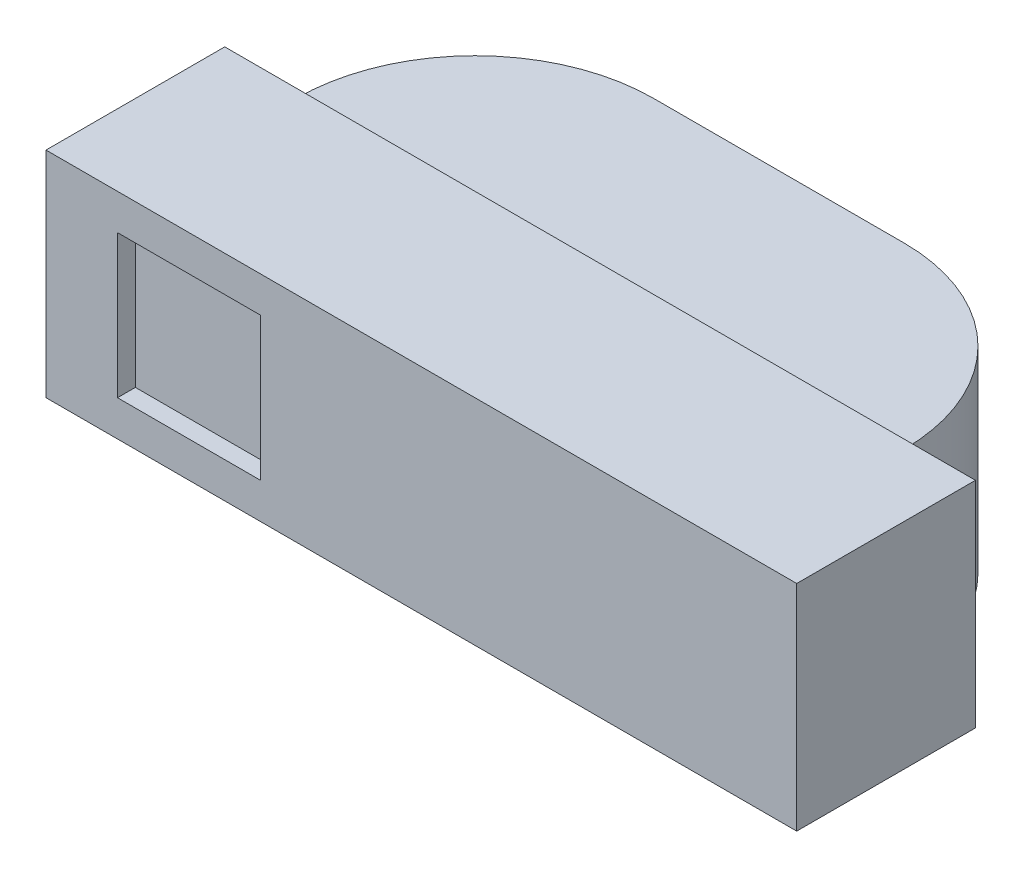
ISO-10303-21;
HEADER;
FILE_DESCRIPTION(('STEP AP214'),'2;1');
FILE_NAME('part.step','',(''),(''),'','','');
FILE_SCHEMA(('AUTOMOTIVE_DESIGN { 1 0 10303 214 1 1 1 1 }'));
ENDSEC;
DATA;
#1=APPLICATION_CONTEXT('core data for automotive mechanical design processes');
#2=APPLICATION_PROTOCOL_DEFINITION('international standard','automotive_design',2000,#1);
#3=PRODUCT_CONTEXT('',#1,'mechanical');
#4=PRODUCT('Part','Part','',(#3));
#5=PRODUCT_RELATED_PRODUCT_CATEGORY('part','',(#4));
#6=PRODUCT_DEFINITION_FORMATION('','',#4);
#7=PRODUCT_DEFINITION_CONTEXT('part definition',#1,'design');
#8=PRODUCT_DEFINITION('design','',#6,#7);
#9=PRODUCT_DEFINITION_SHAPE('','',#8);
#10=(LENGTH_UNIT() NAMED_UNIT(*) SI_UNIT(.MILLI.,.METRE.));
#11=(NAMED_UNIT(*) PLANE_ANGLE_UNIT() SI_UNIT($,.RADIAN.));
#12=(NAMED_UNIT(*) SI_UNIT($,.STERADIAN.) SOLID_ANGLE_UNIT());
#13=UNCERTAINTY_MEASURE_WITH_UNIT(LENGTH_MEASURE(1.E-05),#10,'distance_accuracy_value','');
#14=(GEOMETRIC_REPRESENTATION_CONTEXT(3) GLOBAL_UNCERTAINTY_ASSIGNED_CONTEXT((#13)) GLOBAL_UNIT_ASSIGNED_CONTEXT((#10,
#11,#12)) REPRESENTATION_CONTEXT('',''));
#15=CARTESIAN_POINT('',(0.,0.,0.));
#16=DIRECTION('',(0.,0.,1.));
#17=DIRECTION('',(1.,0.,0.));
#18=AXIS2_PLACEMENT_3D('',#15,#16,#17);
#19=CARTESIAN_POINT('',(-0.35,0.6,0.));
#20=DIRECTION('',(0.,1.,0.));
#21=DIRECTION('',(0.,0.,1.));
#22=AXIS2_PLACEMENT_3D('',#19,#20,#21);
#23=PLANE('',#22);
#24=DIRECTION('',(-1.,0.,0.));
#25=VECTOR('',#24,1.);
#26=CARTESIAN_POINT('',(0.85,0.6,0.));
#27=LINE('',#26,#25);
#28=CARTESIAN_POINT('',(1.05,0.6,0.));
#29=VERTEX_POINT('',#28);
#30=CARTESIAN_POINT('',(-1.05,0.6,0.));
#31=VERTEX_POINT('',#30);
#32=EDGE_CURVE('E59',#29,#31,#27,.T.);
#33=ORIENTED_EDGE('',*,*,#32,.T.);
#34=DIRECTION('',(0.,0.,1.));
#35=VECTOR('',#34,1.);
#36=CARTESIAN_POINT('',(-1.05,0.6,0.5));
#37=LINE('',#36,#35);
#38=CARTESIAN_POINT('',(-1.05,0.6,0.5));
#39=VERTEX_POINT('',#38);
#40=EDGE_CURVE('E194',#31,#39,#37,.T.);
#41=ORIENTED_EDGE('',*,*,#40,.T.);
#42=DIRECTION('',(1.,0.,0.));
#43=VECTOR('',#42,1.);
#44=CARTESIAN_POINT('',(-1.05,0.6,0.5));
#45=LINE('',#44,#43);
#46=CARTESIAN_POINT('',(1.05,0.6,0.5));
#47=VERTEX_POINT('',#46);
#48=EDGE_CURVE('E87',#39,#47,#45,.T.);
#49=ORIENTED_EDGE('',*,*,#48,.T.);
#50=DIRECTION('',(0.,0.,-1.));
#51=VECTOR('',#50,1.);
#52=CARTESIAN_POINT('',(1.05,0.6,0.5));
#53=LINE('',#52,#51);
#54=EDGE_CURVE('E198',#47,#29,#53,.T.);
#55=ORIENTED_EDGE('',*,*,#54,.T.);
#56=EDGE_LOOP('',(#33,#41,#49,#55));
#57=FACE_BOUND('',#56,.T.);
#58=ADVANCED_FACE('F35',(#57),#23,.T.);
#59=CARTESIAN_POINT('',(-1.05,0.6,0.5));
#60=DIRECTION('',(1.,0.,0.));
#61=DIRECTION('',(0.,0.,-1.));
#62=AXIS2_PLACEMENT_3D('',#59,#60,#61);
#63=PLANE('',#62);
#64=DIRECTION('',(0.,0.,1.));
#65=VECTOR('',#64,1.);
#66=CARTESIAN_POINT('',(-1.05,0.,0.5));
#67=LINE('',#66,#65);
#68=CARTESIAN_POINT('',(-1.05,0.,0.));
#69=VERTEX_POINT('',#68);
#70=CARTESIAN_POINT('',(-1.05,0.,0.5));
#71=VERTEX_POINT('',#70);
#72=EDGE_CURVE('E193',#69,#71,#67,.T.);
#73=ORIENTED_EDGE('',*,*,#72,.T.);
#74=DIRECTION('',(0.,-1.,0.));
#75=VECTOR('',#74,1.);
#76=CARTESIAN_POINT('',(-1.05,0.6,0.5));
#77=LINE('',#76,#75);
#78=EDGE_CURVE('E11',#39,#71,#77,.T.);
#79=ORIENTED_EDGE('',*,*,#78,.F.);
#80=ORIENTED_EDGE('',*,*,#40,.F.);
#81=DIRECTION('',(0.,-1.,0.));
#82=VECTOR('',#81,1.);
#83=CARTESIAN_POINT('',(-1.05,0.6,0.));
#84=LINE('',#83,#82);
#85=EDGE_CURVE('E80',#31,#69,#84,.T.);
#86=ORIENTED_EDGE('',*,*,#85,.T.);
#87=EDGE_LOOP('',(#73,#79,#80,#86));
#88=FACE_BOUND('',#87,.T.);
#89=ADVANCED_FACE('F37',(#88),#63,.F.);
#90=CARTESIAN_POINT('',(-1.05,0.6,0.5));
#91=DIRECTION('',(0.,0.,-1.));
#92=DIRECTION('',(-1.,0.,0.));
#93=AXIS2_PLACEMENT_3D('',#90,#91,#92);
#94=PLANE('',#93);
#95=DIRECTION('',(1.,0.,0.));
#96=VECTOR('',#95,1.);
#97=CARTESIAN_POINT('',(-0.85,0.1,0.5));
#98=LINE('',#97,#96);
#99=CARTESIAN_POINT('',(-0.85,0.1,0.5));
#100=VERTEX_POINT('',#99);
#101=CARTESIAN_POINT('',(-0.45,0.1,0.5));
#102=VERTEX_POINT('',#101);
#103=EDGE_CURVE('E162',#100,#102,#98,.T.);
#104=ORIENTED_EDGE('',*,*,#103,.F.);
#105=DIRECTION('',(0.,-1.,0.));
#106=VECTOR('',#105,1.);
#107=CARTESIAN_POINT('',(-0.85,0.5,0.5));
#108=LINE('',#107,#106);
#109=CARTESIAN_POINT('',(-0.85,0.5,0.5));
#110=VERTEX_POINT('',#109);
#111=EDGE_CURVE('E50',#110,#100,#108,.T.);
#112=ORIENTED_EDGE('',*,*,#111,.F.);
#113=DIRECTION('',(-1.,0.,0.));
#114=VECTOR('',#113,1.);
#115=CARTESIAN_POINT('',(-0.85,0.5,0.5));
#116=LINE('',#115,#114);
#117=CARTESIAN_POINT('',(-0.45,0.5,0.5));
#118=VERTEX_POINT('',#117);
#119=EDGE_CURVE('E153',#118,#110,#116,.T.);
#120=ORIENTED_EDGE('',*,*,#119,.F.);
#121=DIRECTION('',(0.,1.,0.));
#122=VECTOR('',#121,1.);
#123=CARTESIAN_POINT('',(-0.45,0.5,0.5));
#124=LINE('',#123,#122);
#125=EDGE_CURVE('E156',#102,#118,#124,.T.);
#126=ORIENTED_EDGE('',*,*,#125,.F.);
#127=EDGE_LOOP('',(#104,#112,#120,#126));
#128=FACE_BOUND('',#127,.T.);
#129=DIRECTION('',(1.,0.,0.));
#130=VECTOR('',#129,1.);
#131=CARTESIAN_POINT('',(-1.05,0.,0.5));
#132=LINE('',#131,#130);
#133=CARTESIAN_POINT('',(1.05,0.,0.5));
#134=VERTEX_POINT('',#133);
#135=EDGE_CURVE('E202',#71,#134,#132,.T.);
#136=ORIENTED_EDGE('',*,*,#135,.T.);
#137=DIRECTION('',(0.,-1.,0.));
#138=VECTOR('',#137,1.);
#139=CARTESIAN_POINT('',(1.05,0.6,0.5));
#140=LINE('',#139,#138);
#141=EDGE_CURVE('E43',#47,#134,#140,.T.);
#142=ORIENTED_EDGE('',*,*,#141,.F.);
#143=ORIENTED_EDGE('',*,*,#48,.F.);
#144=ORIENTED_EDGE('',*,*,#78,.T.);
#145=EDGE_LOOP('',(#136,#142,#143,#144));
#146=FACE_BOUND('',#145,.T.);
#147=ADVANCED_FACE('F240',(#128,#146),#94,.F.);
#148=CARTESIAN_POINT('',(1.05,0.6,0.5));
#149=DIRECTION('',(-1.,0.,0.));
#150=DIRECTION('',(0.,0.,1.));
#151=AXIS2_PLACEMENT_3D('',#148,#149,#150);
#152=PLANE('',#151);
#153=DIRECTION('',(0.,0.,-1.));
#154=VECTOR('',#153,1.);
#155=CARTESIAN_POINT('',(1.05,0.,0.5));
#156=LINE('',#155,#154);
#157=CARTESIAN_POINT('',(1.05,0.,0.));
#158=VERTEX_POINT('',#157);
#159=EDGE_CURVE('E204',#134,#158,#156,.T.);
#160=ORIENTED_EDGE('',*,*,#159,.T.);
#161=DIRECTION('',(0.,-1.,0.));
#162=VECTOR('',#161,1.);
#163=CARTESIAN_POINT('',(1.05,0.6,0.));
#164=LINE('',#163,#162);
#165=EDGE_CURVE('E221',#29,#158,#164,.T.);
#166=ORIENTED_EDGE('',*,*,#165,.F.);
#167=ORIENTED_EDGE('',*,*,#54,.F.);
#168=ORIENTED_EDGE('',*,*,#141,.T.);
#169=EDGE_LOOP('',(#160,#166,#167,#168));
#170=FACE_BOUND('',#169,.T.);
#171=ADVANCED_FACE('F226',(#170),#152,.F.);
#172=CARTESIAN_POINT('',(0.35,0.6,0.));
#173=DIRECTION('',(0.,-1.,0.));
#174=DIRECTION('',(0.,0.,-1.));
#175=AXIS2_PLACEMENT_3D('',#172,#173,#174);
#176=CYLINDRICAL_SURFACE('',#175,0.5);
#177=DIRECTION('',(0.,-1.,0.));
#178=VECTOR('',#177,1.);
#179=CARTESIAN_POINT('',(0.85,0.6,0.));
#180=LINE('',#179,#178);
#181=CARTESIAN_POINT('',(0.85,0.575,0.));
#182=VERTEX_POINT('',#181);
#183=CARTESIAN_POINT('',(0.85,0.025,0.));
#184=VERTEX_POINT('',#183);
#185=EDGE_CURVE('E218',#182,#184,#180,.T.);
#186=ORIENTED_EDGE('',*,*,#185,.T.);
#187=CARTESIAN_POINT('',(0.35,0.025,0.));
#188=DIRECTION('',(0.,1.,0.));
#189=DIRECTION('',(-1.,0.,0.));
#190=AXIS2_PLACEMENT_3D('',#187,#188,#189);
#191=CIRCLE('',#190,0.5);
#192=CARTESIAN_POINT('',(0.35,0.025,-0.5));
#193=VERTEX_POINT('',#192);
#194=EDGE_CURVE('E179',#184,#193,#191,.T.);
#195=ORIENTED_EDGE('',*,*,#194,.T.);
#196=DIRECTION('',(0.,-1.,0.));
#197=VECTOR('',#196,1.);
#198=CARTESIAN_POINT('',(0.35,0.6,-0.5));
#199=LINE('',#198,#197);
#200=CARTESIAN_POINT('',(0.35,0.575,-0.5));
#201=VERTEX_POINT('',#200);
#202=EDGE_CURVE('E215',#201,#193,#199,.T.);
#203=ORIENTED_EDGE('',*,*,#202,.F.);
#204=CARTESIAN_POINT('',(0.35,0.575,0.));
#205=DIRECTION('',(0.,-1.,0.));
#206=DIRECTION('',(0.,0.,-1.));
#207=AXIS2_PLACEMENT_3D('',#204,#205,#206);
#208=CIRCLE('',#207,0.5);
#209=EDGE_CURVE('E190',#201,#182,#208,.T.);
#210=ORIENTED_EDGE('',*,*,#209,.T.);
#211=EDGE_LOOP('',(#186,#195,#203,#210));
#212=FACE_BOUND('',#211,.T.);
#213=ADVANCED_FACE('F257',(#212),#176,.T.);
#214=CARTESIAN_POINT('',(-0.35,0.6,-0.5));
#215=DIRECTION('',(0.,0.,1.));
#216=DIRECTION('',(1.,0.,0.));
#217=AXIS2_PLACEMENT_3D('',#214,#215,#216);
#218=PLANE('',#217);
#219=ORIENTED_EDGE('',*,*,#202,.T.);
#220=DIRECTION('',(1.,0.,0.));
#221=VECTOR('',#220,1.);
#222=CARTESIAN_POINT('',(1.05,0.025,-0.5));
#223=LINE('',#222,#221);
#224=CARTESIAN_POINT('',(-0.35,0.025,-0.5));
#225=VERTEX_POINT('',#224);
#226=EDGE_CURVE('E168',#225,#193,#223,.T.);
#227=ORIENTED_EDGE('',*,*,#226,.F.);
#228=DIRECTION('',(0.,-1.,0.));
#229=VECTOR('',#228,1.);
#230=CARTESIAN_POINT('',(-0.35,0.6,-0.5));
#231=LINE('',#230,#229);
#232=CARTESIAN_POINT('',(-0.35,0.575,-0.5));
#233=VERTEX_POINT('',#232);
#234=EDGE_CURVE('E212',#233,#225,#231,.T.);
#235=ORIENTED_EDGE('',*,*,#234,.F.);
#236=DIRECTION('',(-1.,0.,0.));
#237=VECTOR('',#236,1.);
#238=CARTESIAN_POINT('',(1.05,0.575,-0.5));
#239=LINE('',#238,#237);
#240=EDGE_CURVE('E182',#201,#233,#239,.T.);
#241=ORIENTED_EDGE('',*,*,#240,.F.);
#242=EDGE_LOOP('',(#219,#227,#235,#241));
#243=FACE_BOUND('',#242,.T.);
#244=ADVANCED_FACE('F253',(#243),#218,.F.);
#245=CARTESIAN_POINT('',(-0.35,0.6,0.));
#246=DIRECTION('',(0.,-1.,0.));
#247=DIRECTION('',(0.,0.,-1.));
#248=AXIS2_PLACEMENT_3D('',#245,#246,#247);
#249=CYLINDRICAL_SURFACE('',#248,0.5);
#250=ORIENTED_EDGE('',*,*,#234,.T.);
#251=CARTESIAN_POINT('',(-0.35,0.025,0.));
#252=DIRECTION('',(0.,1.,0.));
#253=DIRECTION('',(-1.,0.,0.));
#254=AXIS2_PLACEMENT_3D('',#251,#252,#253);
#255=CIRCLE('',#254,0.5);
#256=CARTESIAN_POINT('',(-0.85,0.025,0.));
#257=VERTEX_POINT('',#256);
#258=EDGE_CURVE('E175',#225,#257,#255,.T.);
#259=ORIENTED_EDGE('',*,*,#258,.T.);
#260=DIRECTION('',(0.,-1.,0.));
#261=VECTOR('',#260,1.);
#262=CARTESIAN_POINT('',(-0.85,0.6,0.));
#263=LINE('',#262,#261);
#264=CARTESIAN_POINT('',(-0.85,0.575,0.));
#265=VERTEX_POINT('',#264);
#266=EDGE_CURVE('E209',#265,#257,#263,.T.);
#267=ORIENTED_EDGE('',*,*,#266,.F.);
#268=CARTESIAN_POINT('',(-0.35,0.575,0.));
#269=DIRECTION('',(0.,-1.,0.));
#270=DIRECTION('',(0.,0.,-1.));
#271=AXIS2_PLACEMENT_3D('',#268,#269,#270);
#272=CIRCLE('',#271,0.5);
#273=EDGE_CURVE('E186',#265,#233,#272,.T.);
#274=ORIENTED_EDGE('',*,*,#273,.T.);
#275=EDGE_LOOP('',(#250,#259,#267,#274));
#276=FACE_BOUND('',#275,.T.);
#277=ADVANCED_FACE('F249',(#276),#249,.T.);
#278=CARTESIAN_POINT('',(-1.05,0.6,0.));
#279=DIRECTION('',(0.,0.,1.));
#280=DIRECTION('',(1.,0.,0.));
#281=AXIS2_PLACEMENT_3D('',#278,#279,#280);
#282=PLANE('',#281);
#283=DIRECTION('',(1.,0.,0.));
#284=VECTOR('',#283,1.);
#285=CARTESIAN_POINT('',(1.05,0.025,0.));
#286=LINE('',#285,#284);
#287=EDGE_CURVE('E172',#257,#184,#286,.T.);
#288=ORIENTED_EDGE('',*,*,#287,.T.);
#289=ORIENTED_EDGE('',*,*,#185,.F.);
#290=DIRECTION('',(-1.,0.,0.));
#291=VECTOR('',#290,1.);
#292=CARTESIAN_POINT('',(1.05,0.575,0.));
#293=LINE('',#292,#291);
#294=EDGE_CURVE('E183',#182,#265,#293,.T.);
#295=ORIENTED_EDGE('',*,*,#294,.T.);
#296=ORIENTED_EDGE('',*,*,#266,.T.);
#297=EDGE_LOOP('',(#288,#289,#295,#296));
#298=FACE_BOUND('',#297,.T.);
#299=ORIENTED_EDGE('',*,*,#165,.T.);
#300=DIRECTION('',(-1.,0.,0.));
#301=VECTOR('',#300,1.);
#302=CARTESIAN_POINT('',(-1.05,0.,0.));
#303=LINE('',#302,#301);
#304=EDGE_CURVE('E196',#158,#69,#303,.T.);
#305=ORIENTED_EDGE('',*,*,#304,.T.);
#306=ORIENTED_EDGE('',*,*,#85,.F.);
#307=ORIENTED_EDGE('',*,*,#32,.F.);
#308=EDGE_LOOP('',(#299,#305,#306,#307));
#309=FACE_BOUND('',#308,.T.);
#310=ADVANCED_FACE('F233',(#298,#309),#282,.F.);
#311=CARTESIAN_POINT('',(-0.35,0.,0.));
#312=DIRECTION('',(0.,1.,0.));
#313=DIRECTION('',(0.,0.,1.));
#314=AXIS2_PLACEMENT_3D('',#311,#312,#313);
#315=PLANE('',#314);
#316=ORIENTED_EDGE('',*,*,#304,.F.);
#317=ORIENTED_EDGE('',*,*,#159,.F.);
#318=ORIENTED_EDGE('',*,*,#135,.F.);
#319=ORIENTED_EDGE('',*,*,#72,.F.);
#320=EDGE_LOOP('',(#316,#317,#318,#319));
#321=FACE_BOUND('',#320,.T.);
#322=ADVANCED_FACE('F230',(#321),#315,.F.);
#323=CARTESIAN_POINT('',(1.05,0.575,0.));
#324=DIRECTION('',(0.,-1.,0.));
#325=DIRECTION('',(0.,0.,-1.));
#326=AXIS2_PLACEMENT_3D('',#323,#324,#325);
#327=PLANE('',#326);
#328=ORIENTED_EDGE('',*,*,#240,.T.);
#329=ORIENTED_EDGE('',*,*,#273,.F.);
#330=ORIENTED_EDGE('',*,*,#294,.F.);
#331=ORIENTED_EDGE('',*,*,#209,.F.);
#332=EDGE_LOOP('',(#328,#329,#330,#331));
#333=FACE_BOUND('',#332,.T.);
#334=ADVANCED_FACE('F243',(#333),#327,.F.);
#335=CARTESIAN_POINT('',(1.05,0.025,0.));
#336=DIRECTION('',(0.,1.,0.));
#337=DIRECTION('',(-1.,0.,0.));
#338=AXIS2_PLACEMENT_3D('',#335,#336,#337);
#339=PLANE('',#338);
#340=ORIENTED_EDGE('',*,*,#287,.F.);
#341=ORIENTED_EDGE('',*,*,#258,.F.);
#342=ORIENTED_EDGE('',*,*,#226,.T.);
#343=ORIENTED_EDGE('',*,*,#194,.F.);
#344=EDGE_LOOP('',(#340,#341,#342,#343));
#345=FACE_BOUND('',#344,.T.);
#346=ADVANCED_FACE('F280',(#345),#339,.F.);
#347=CARTESIAN_POINT('',(-0.85,0.5,0.45));
#348=DIRECTION('',(-1.,0.,0.));
#349=DIRECTION('',(0.,0.,1.));
#350=AXIS2_PLACEMENT_3D('',#347,#348,#349);
#351=PLANE('',#350);
#352=ORIENTED_EDGE('',*,*,#111,.T.);
#353=DIRECTION('',(0.,0.,1.));
#354=VECTOR('',#353,1.);
#355=CARTESIAN_POINT('',(-0.85,0.1,0.45));
#356=LINE('',#355,#354);
#357=CARTESIAN_POINT('',(-0.85,0.1,0.45));
#358=VERTEX_POINT('',#357);
#359=EDGE_CURVE('E131',#358,#100,#356,.T.);
#360=ORIENTED_EDGE('',*,*,#359,.F.);
#361=DIRECTION('',(0.,-1.,0.));
#362=VECTOR('',#361,1.);
#363=CARTESIAN_POINT('',(-0.85,0.5,0.45));
#364=LINE('',#363,#362);
#365=CARTESIAN_POINT('',(-0.85,0.5,0.45));
#366=VERTEX_POINT('',#365);
#367=EDGE_CURVE('E135',#366,#358,#364,.T.);
#368=ORIENTED_EDGE('',*,*,#367,.F.);
#369=DIRECTION('',(0.,0.,1.));
#370=VECTOR('',#369,1.);
#371=CARTESIAN_POINT('',(-0.85,0.5,0.45));
#372=LINE('',#371,#370);
#373=EDGE_CURVE('E166',#366,#110,#372,.T.);
#374=ORIENTED_EDGE('',*,*,#373,.T.);
#375=EDGE_LOOP('',(#352,#360,#368,#374));
#376=FACE_BOUND('',#375,.T.);
#377=ADVANCED_FACE('F133',(#376),#351,.F.);
#378=CARTESIAN_POINT('',(-0.85,0.5,0.45));
#379=DIRECTION('',(0.,1.,0.));
#380=DIRECTION('',(0.,0.,1.));
#381=AXIS2_PLACEMENT_3D('',#378,#379,#380);
#382=PLANE('',#381);
#383=ORIENTED_EDGE('',*,*,#119,.T.);
#384=ORIENTED_EDGE('',*,*,#373,.F.);
#385=DIRECTION('',(-1.,0.,0.));
#386=VECTOR('',#385,1.);
#387=CARTESIAN_POINT('',(-0.85,0.5,0.45));
#388=LINE('',#387,#386);
#389=CARTESIAN_POINT('',(-0.45,0.5,0.45));
#390=VERTEX_POINT('',#389);
#391=EDGE_CURVE('E141',#390,#366,#388,.T.);
#392=ORIENTED_EDGE('',*,*,#391,.F.);
#393=DIRECTION('',(0.,0.,1.));
#394=VECTOR('',#393,1.);
#395=CARTESIAN_POINT('',(-0.45,0.5,0.45));
#396=LINE('',#395,#394);
#397=EDGE_CURVE('E169',#390,#118,#396,.T.);
#398=ORIENTED_EDGE('',*,*,#397,.T.);
#399=EDGE_LOOP('',(#383,#384,#392,#398));
#400=FACE_BOUND('',#399,.T.);
#401=ADVANCED_FACE('F272',(#400),#382,.F.);
#402=CARTESIAN_POINT('',(-0.45,0.5,0.45));
#403=DIRECTION('',(1.,0.,0.));
#404=DIRECTION('',(0.,1.,0.));
#405=AXIS2_PLACEMENT_3D('',#402,#403,#404);
#406=PLANE('',#405);
#407=ORIENTED_EDGE('',*,*,#125,.T.);
#408=ORIENTED_EDGE('',*,*,#397,.F.);
#409=DIRECTION('',(0.,1.,0.));
#410=VECTOR('',#409,1.);
#411=CARTESIAN_POINT('',(-0.45,0.5,0.45));
#412=LINE('',#411,#410);
#413=CARTESIAN_POINT('',(-0.45,0.1,0.45));
#414=VERTEX_POINT('',#413);
#415=EDGE_CURVE('E149',#414,#390,#412,.T.);
#416=ORIENTED_EDGE('',*,*,#415,.F.);
#417=DIRECTION('',(0.,0.,1.));
#418=VECTOR('',#417,1.);
#419=CARTESIAN_POINT('',(-0.45,0.1,0.45));
#420=LINE('',#419,#418);
#421=EDGE_CURVE('E140',#414,#102,#420,.T.);
#422=ORIENTED_EDGE('',*,*,#421,.T.);
#423=EDGE_LOOP('',(#407,#408,#416,#422));
#424=FACE_BOUND('',#423,.T.);
#425=ADVANCED_FACE('F270',(#424),#406,.F.);
#426=CARTESIAN_POINT('',(-0.85,0.1,0.45));
#427=DIRECTION('',(0.,-1.,0.));
#428=DIRECTION('',(0.,0.,-1.));
#429=AXIS2_PLACEMENT_3D('',#426,#427,#428);
#430=PLANE('',#429);
#431=ORIENTED_EDGE('',*,*,#103,.T.);
#432=ORIENTED_EDGE('',*,*,#421,.F.);
#433=DIRECTION('',(1.,0.,0.));
#434=VECTOR('',#433,1.);
#435=CARTESIAN_POINT('',(-0.85,0.1,0.45));
#436=LINE('',#435,#434);
#437=EDGE_CURVE('E144',#358,#414,#436,.T.);
#438=ORIENTED_EDGE('',*,*,#437,.F.);
#439=ORIENTED_EDGE('',*,*,#359,.T.);
#440=EDGE_LOOP('',(#431,#432,#438,#439));
#441=FACE_BOUND('',#440,.T.);
#442=ADVANCED_FACE('F145',(#441),#430,.F.);
#443=CARTESIAN_POINT('',(-0.85,0.1,0.45));
#444=DIRECTION('',(0.,0.,1.));
#445=DIRECTION('',(1.,0.,0.));
#446=AXIS2_PLACEMENT_3D('',#443,#444,#445);
#447=PLANE('',#446);
#448=ORIENTED_EDGE('',*,*,#367,.T.);
#449=ORIENTED_EDGE('',*,*,#437,.T.);
#450=ORIENTED_EDGE('',*,*,#415,.T.);
#451=ORIENTED_EDGE('',*,*,#391,.T.);
#452=EDGE_LOOP('',(#448,#449,#450,#451));
#453=FACE_BOUND('',#452,.T.);
#454=ADVANCED_FACE('F151',(#453),#447,.T.);
#455=CLOSED_SHELL('',(#58,#89,#147,#171,#213,#244,#277,#310,#322,#334,#346,#377,#401,#425,#442,#454));
#456=MANIFOLD_SOLID_BREP('B2',#455);
#457=ADVANCED_BREP_SHAPE_REPRESENTATION('',(#18,#456),#14);
#458=SHAPE_DEFINITION_REPRESENTATION(#9,#457);
ENDSEC;
END-ISO-10303-21;
